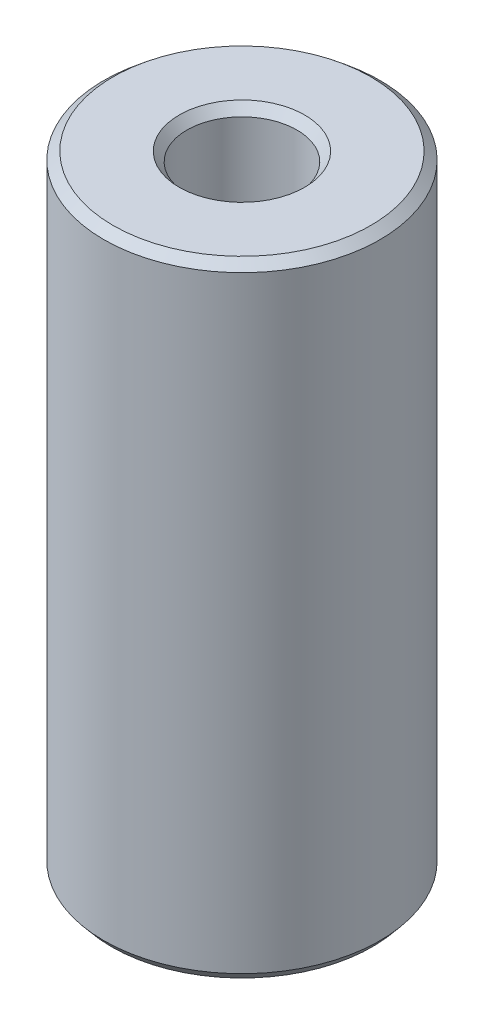
ISO-10303-21;
HEADER;
FILE_DESCRIPTION(('STEP AP214'),'2;1');
FILE_NAME('part.step','',(''),(''),'','','');
FILE_SCHEMA(('AUTOMOTIVE_DESIGN { 1 0 10303 214 1 1 1 1 }'));
ENDSEC;
DATA;
#1=APPLICATION_CONTEXT('core data for automotive mechanical design processes');
#2=APPLICATION_PROTOCOL_DEFINITION('international standard','automotive_design',2000,#1);
#3=PRODUCT_CONTEXT('',#1,'mechanical');
#4=PRODUCT('Part','Part','',(#3));
#5=PRODUCT_RELATED_PRODUCT_CATEGORY('part','',(#4));
#6=PRODUCT_DEFINITION_FORMATION('','',#4);
#7=PRODUCT_DEFINITION_CONTEXT('part definition',#1,'design');
#8=PRODUCT_DEFINITION('design','',#6,#7);
#9=PRODUCT_DEFINITION_SHAPE('','',#8);
#10=(LENGTH_UNIT() NAMED_UNIT(*) SI_UNIT(.MILLI.,.METRE.));
#11=(NAMED_UNIT(*) PLANE_ANGLE_UNIT() SI_UNIT($,.RADIAN.));
#12=(NAMED_UNIT(*) SI_UNIT($,.STERADIAN.) SOLID_ANGLE_UNIT());
#13=UNCERTAINTY_MEASURE_WITH_UNIT(LENGTH_MEASURE(1.E-05),#10,'distance_accuracy_value','');
#14=(GEOMETRIC_REPRESENTATION_CONTEXT(3) GLOBAL_UNCERTAINTY_ASSIGNED_CONTEXT((#13)) GLOBAL_UNIT_ASSIGNED_CONTEXT((#10,
#11,#12)) REPRESENTATION_CONTEXT('',''));
#15=CARTESIAN_POINT('',(0.,0.,0.));
#16=DIRECTION('',(0.,0.,1.));
#17=DIRECTION('',(1.,0.,0.));
#18=AXIS2_PLACEMENT_3D('',#15,#16,#17);
#19=CARTESIAN_POINT('',(0.,79.117678603685,0.));
#20=DIRECTION('',(0.,-1.,0.));
#21=DIRECTION('',(0.,0.,-1.));
#22=AXIS2_PLACEMENT_3D('',#19,#20,#21);
#23=CYLINDRICAL_SURFACE('',#22,17.5);
#24=CARTESIAN_POINT('',(0.,1.1674448356485,0.));
#25=DIRECTION('',(0.,1.,0.));
#26=DIRECTION('',(0.,0.,1.));
#27=AXIS2_PLACEMENT_3D('',#24,#25,#26);
#28=CIRCLE('',#27,17.5);
#29=CARTESIAN_POINT('',(0.,1.1674448356485,17.5));
#30=VERTEX_POINT('',#29);
#31=EDGE_CURVE('E10',#30,#30,#28,.T.);
#32=ORIENTED_EDGE('',*,*,#31,.T.);
#33=EDGE_LOOP('',(#32));
#34=FACE_BOUND('',#33,.T.);
#35=CARTESIAN_POINT('',(0.,78.1439743523342,0.));
#36=DIRECTION('',(0.,1.,0.));
#37=DIRECTION('',(0.,0.,1.));
#38=AXIS2_PLACEMENT_3D('',#35,#36,#37);
#39=CIRCLE('',#38,17.5);
#40=CARTESIAN_POINT('',(0.,78.1439743523342,17.5));
#41=VERTEX_POINT('',#40);
#42=EDGE_CURVE('E50',#41,#41,#39,.F.);
#43=ORIENTED_EDGE('',*,*,#42,.T.);
#44=EDGE_LOOP('',(#43));
#45=FACE_BOUND('',#44,.T.);
#46=ADVANCED_FACE('F39',(#34,#45),#23,.T.);
#47=CARTESIAN_POINT('',(0.,79.117678603685,0.));
#48=DIRECTION('',(0.,1.,0.));
#49=DIRECTION('',(0.,0.,1.));
#50=AXIS2_PLACEMENT_3D('',#47,#48,#49);
#51=PLANE('',#50);
#52=CARTESIAN_POINT('',(0.,79.117678603685,0.));
#53=DIRECTION('',(0.,1.,0.));
#54=DIRECTION('',(0.,0.,1.));
#55=AXIS2_PLACEMENT_3D('',#52,#53,#54);
#56=CIRCLE('',#55,7.95263563444425);
#57=CARTESIAN_POINT('',(0.,79.117678603685,7.95263563444425));
#58=VERTEX_POINT('',#57);
#59=EDGE_CURVE('E58',#58,#58,#56,.F.);
#60=ORIENTED_EDGE('',*,*,#59,.T.);
#61=EDGE_LOOP('',(#60));
#62=FACE_BOUND('',#61,.T.);
#63=CARTESIAN_POINT('',(0.,79.117678603685,0.));
#64=DIRECTION('',(0.,1.,0.));
#65=DIRECTION('',(0.,0.,1.));
#66=AXIS2_PLACEMENT_3D('',#63,#64,#65);
#67=CIRCLE('',#66,16.3325551643515);
#68=CARTESIAN_POINT('',(0.,79.117678603685,16.3325551643515));
#69=VERTEX_POINT('',#68);
#70=EDGE_CURVE('E61',#69,#69,#67,.T.);
#71=ORIENTED_EDGE('',*,*,#70,.T.);
#72=EDGE_LOOP('',(#71));
#73=FACE_BOUND('',#72,.T.);
#74=ADVANCED_FACE('F88',(#62,#73),#51,.T.);
#75=CARTESIAN_POINT('',(0.,0.,0.));
#76=DIRECTION('',(0.,1.,0.));
#77=DIRECTION('',(0.,0.,1.));
#78=AXIS2_PLACEMENT_3D('',#75,#76,#77);
#79=PLANE('',#78);
#80=CARTESIAN_POINT('',(0.,0.,0.));
#81=DIRECTION('',(0.,1.,0.));
#82=DIRECTION('',(0.,0.,1.));
#83=AXIS2_PLACEMENT_3D('',#80,#81,#82);
#84=CIRCLE('',#83,8.14637621874195);
#85=CARTESIAN_POINT('',(0.,0.,8.14637621874195));
#86=VERTEX_POINT('',#85);
#87=EDGE_CURVE('E51',#86,#86,#84,.T.);
#88=ORIENTED_EDGE('',*,*,#87,.T.);
#89=EDGE_LOOP('',(#88));
#90=FACE_BOUND('',#89,.T.);
#91=CARTESIAN_POINT('',(0.,0.,0.));
#92=DIRECTION('',(0.,1.,0.));
#93=DIRECTION('',(0.,0.,1.));
#94=AXIS2_PLACEMENT_3D('',#91,#92,#93);
#95=CIRCLE('',#94,16.5262957486492);
#96=CARTESIAN_POINT('',(0.,0.,16.5262957486492));
#97=VERTEX_POINT('',#96);
#98=EDGE_CURVE('E54',#97,#97,#95,.F.);
#99=ORIENTED_EDGE('',*,*,#98,.T.);
#100=EDGE_LOOP('',(#99));
#101=FACE_BOUND('',#100,.T.);
#102=ADVANCED_FACE('F83',(#90,#101),#79,.F.);
#103=CARTESIAN_POINT('',(0.,79.117678603685,0.));
#104=DIRECTION('',(0.,-1.,0.));
#105=DIRECTION('',(0.,0.,-1.));
#106=AXIS2_PLACEMENT_3D('',#103,#104,#105);
#107=CYLINDRICAL_SURFACE('',#106,6.97893138309342);
#108=CARTESIAN_POINT('',(0.,77.9502337680365,0.));
#109=DIRECTION('',(0.,1.,0.));
#110=DIRECTION('',(0.,0.,1.));
#111=AXIS2_PLACEMENT_3D('',#108,#109,#110);
#112=CIRCLE('',#111,6.97893138309342);
#113=CARTESIAN_POINT('',(0.,77.9502337680365,6.97893138309342));
#114=VERTEX_POINT('',#113);
#115=EDGE_CURVE('E67',#114,#114,#112,.T.);
#116=ORIENTED_EDGE('',*,*,#115,.T.);
#117=EDGE_LOOP('',(#116));
#118=FACE_BOUND('',#117,.T.);
#119=CARTESIAN_POINT('',(0.,0.973704251350821,0.));
#120=DIRECTION('',(0.,1.,0.));
#121=DIRECTION('',(0.,0.,1.));
#122=AXIS2_PLACEMENT_3D('',#119,#120,#121);
#123=CIRCLE('',#122,6.97893138309342);
#124=CARTESIAN_POINT('',(0.,0.973704251350821,6.97893138309342));
#125=VERTEX_POINT('',#124);
#126=EDGE_CURVE('E69',#125,#125,#123,.F.);
#127=ORIENTED_EDGE('',*,*,#126,.T.);
#128=EDGE_LOOP('',(#127));
#129=FACE_BOUND('',#128,.T.);
#130=ADVANCED_FACE('F71',(#118,#129),#107,.F.);
#131=CARTESIAN_POINT('',(0.,77.9502337680365,0.));
#132=DIRECTION('',(0.,1.,0.));
#133=DIRECTION('',(0.,0.,1.));
#134=AXIS2_PLACEMENT_3D('',#131,#132,#133);
#135=CONICAL_SURFACE('',#134,6.97893138309342,0.695159504986308);
#136=ORIENTED_EDGE('',*,*,#59,.F.);
#137=EDGE_LOOP('',(#136));
#138=FACE_BOUND('',#137,.T.);
#139=ORIENTED_EDGE('',*,*,#115,.F.);
#140=EDGE_LOOP('',(#139));
#141=FACE_BOUND('',#140,.T.);
#142=ADVANCED_FACE('F77',(#138,#141),#135,.F.);
#143=CARTESIAN_POINT('',(0.,0.,0.));
#144=DIRECTION('',(0.,-1.,0.));
#145=DIRECTION('',(0.,0.,-1.));
#146=AXIS2_PLACEMENT_3D('',#143,#144,#145);
#147=CONICAL_SURFACE('',#146,8.14637621874195,0.875636821808587);
#148=ORIENTED_EDGE('',*,*,#126,.F.);
#149=EDGE_LOOP('',(#148));
#150=FACE_BOUND('',#149,.T.);
#151=ORIENTED_EDGE('',*,*,#87,.F.);
#152=EDGE_LOOP('',(#151));
#153=FACE_BOUND('',#152,.T.);
#154=ADVANCED_FACE('F73',(#150,#153),#147,.F.);
#155=CARTESIAN_POINT('',(0.,1.1674448356485,0.));
#156=DIRECTION('',(0.,1.,0.));
#157=DIRECTION('',(0.,0.,1.));
#158=AXIS2_PLACEMENT_3D('',#155,#156,#157);
#159=CONICAL_SURFACE('',#158,17.5,0.695159504986307);
#160=ORIENTED_EDGE('',*,*,#98,.F.);
#161=EDGE_LOOP('',(#160));
#162=FACE_BOUND('',#161,.T.);
#163=ORIENTED_EDGE('',*,*,#31,.F.);
#164=EDGE_LOOP('',(#163));
#165=FACE_BOUND('',#164,.T.);
#166=ADVANCED_FACE('F76',(#162,#165),#159,.T.);
#167=CARTESIAN_POINT('',(0.,79.117678603685,0.));
#168=DIRECTION('',(0.,-1.,0.));
#169=DIRECTION('',(0.,0.,-1.));
#170=AXIS2_PLACEMENT_3D('',#167,#168,#169);
#171=CONICAL_SURFACE('',#170,16.3325551643515,0.875636821808585);
#172=ORIENTED_EDGE('',*,*,#42,.F.);
#173=EDGE_LOOP('',(#172));
#174=FACE_BOUND('',#173,.T.);
#175=ORIENTED_EDGE('',*,*,#70,.F.);
#176=EDGE_LOOP('',(#175));
#177=FACE_BOUND('',#176,.T.);
#178=ADVANCED_FACE('F45',(#174,#177),#171,.T.);
#179=CLOSED_SHELL('',(#46,#74,#102,#130,#142,#154,#166,#178));
#180=MANIFOLD_SOLID_BREP('B2',#179);
#181=ADVANCED_BREP_SHAPE_REPRESENTATION('',(#18,#180),#14);
#182=SHAPE_DEFINITION_REPRESENTATION(#9,#181);
ENDSEC;
END-ISO-10303-21;
